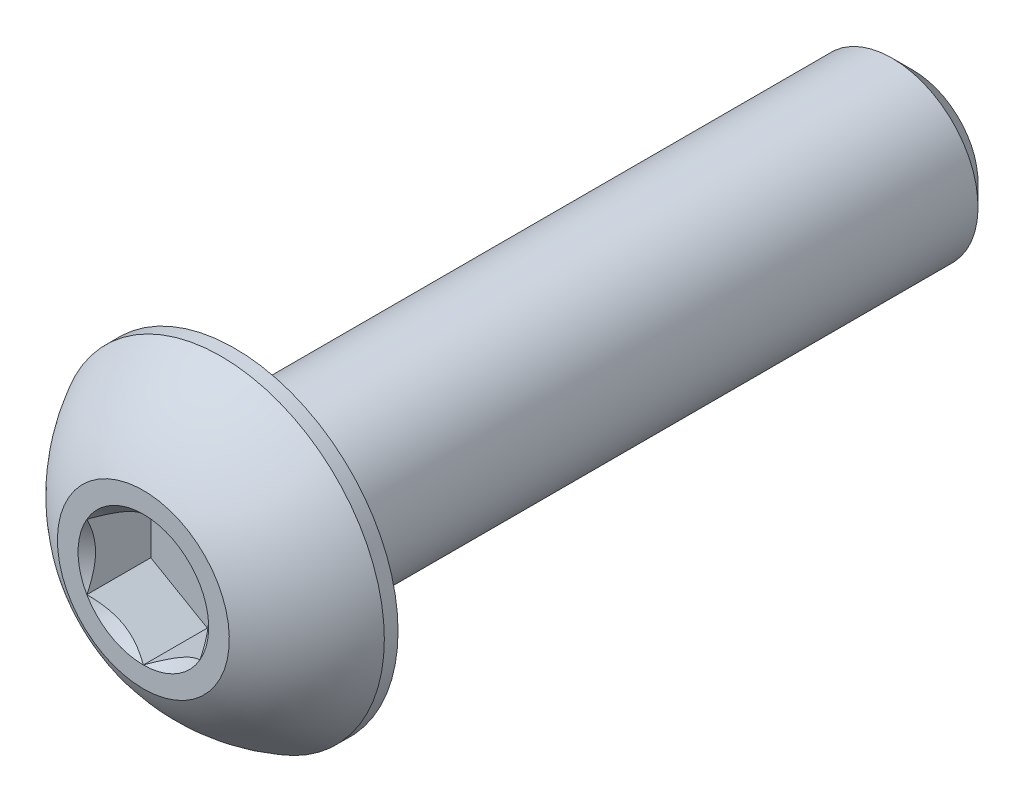
ISO-10303-21;
HEADER;
FILE_DESCRIPTION(('STEP AP214'),'2;1');
FILE_NAME('part.step','',(''),(''),'','','');
FILE_SCHEMA(('AUTOMOTIVE_DESIGN { 1 0 10303 214 1 1 1 1 }'));
ENDSEC;
DATA;
#1=APPLICATION_CONTEXT('core data for automotive mechanical design processes');
#2=APPLICATION_PROTOCOL_DEFINITION('international standard','automotive_design',2000,#1);
#3=PRODUCT_CONTEXT('',#1,'mechanical');
#4=PRODUCT('Part','Part','',(#3));
#5=PRODUCT_RELATED_PRODUCT_CATEGORY('part','',(#4));
#6=PRODUCT_DEFINITION_FORMATION('','',#4);
#7=PRODUCT_DEFINITION_CONTEXT('part definition',#1,'design');
#8=PRODUCT_DEFINITION('design','',#6,#7);
#9=PRODUCT_DEFINITION_SHAPE('','',#8);
#10=(LENGTH_UNIT() NAMED_UNIT(*) SI_UNIT(.MILLI.,.METRE.));
#11=(NAMED_UNIT(*) PLANE_ANGLE_UNIT() SI_UNIT($,.RADIAN.));
#12=(NAMED_UNIT(*) SI_UNIT($,.STERADIAN.) SOLID_ANGLE_UNIT());
#13=UNCERTAINTY_MEASURE_WITH_UNIT(LENGTH_MEASURE(1.E-05),#10,'distance_accuracy_value','');
#14=(GEOMETRIC_REPRESENTATION_CONTEXT(3) GLOBAL_UNCERTAINTY_ASSIGNED_CONTEXT((#13)) GLOBAL_UNIT_ASSIGNED_CONTEXT((#10,
#11,#12)) REPRESENTATION_CONTEXT('',''));
#15=CARTESIAN_POINT('',(0.,0.,0.));
#16=DIRECTION('',(0.,0.,1.));
#17=DIRECTION('',(1.,0.,0.));
#18=AXIS2_PLACEMENT_3D('',#15,#16,#17);
#19=CARTESIAN_POINT('',(0.,-2.41300000000001,-21.6154));
#20=DIRECTION('',(0.,0.,-1.));
#21=DIRECTION('',(0.,1.,0.));
#22=AXIS2_PLACEMENT_3D('',#19,#20,#21);
#23=PLANE('',#22);
#24=CARTESIAN_POINT('',(0.,0.,-21.6154));
#25=DIRECTION('',(0.,0.,-1.));
#26=DIRECTION('',(0.,1.,0.));
#27=AXIS2_PLACEMENT_3D('',#24,#25,#26);
#28=CIRCLE('',#27,1.81768750000001);
#29=CARTESIAN_POINT('',(0.,1.81768750000001,-21.6154));
#30=VERTEX_POINT('',#29);
#31=EDGE_CURVE('E45',#30,#30,#28,.T.);
#32=ORIENTED_EDGE('',*,*,#31,.T.);
#33=EDGE_LOOP('',(#32));
#34=FACE_BOUND('',#33,.T.);
#35=ADVANCED_FACE('F37',(#34),#23,.T.);
#36=CARTESIAN_POINT('',(0.,0.,-21.6154));
#37=DIRECTION('',(0.,0.,-1.));
#38=DIRECTION('',(0.,1.,0.));
#39=AXIS2_PLACEMENT_3D('',#36,#37,#38);
#40=CYLINDRICAL_SURFACE('',#39,2.413);
#41=CARTESIAN_POINT('',(0.,0.,-21.0200875));
#42=DIRECTION('',(0.,0.,-1.));
#43=DIRECTION('',(0.,1.,0.));
#44=AXIS2_PLACEMENT_3D('',#41,#42,#43);
#45=CIRCLE('',#44,2.413);
#46=CARTESIAN_POINT('',(0.,2.413,-21.0200875));
#47=VERTEX_POINT('',#46);
#48=EDGE_CURVE('E11',#47,#47,#45,.F.);
#49=ORIENTED_EDGE('',*,*,#48,.T.);
#50=EDGE_LOOP('',(#49));
#51=FACE_BOUND('',#50,.T.);
#52=CARTESIAN_POINT('',(0.,0.,-2.5654));
#53=DIRECTION('',(0.,0.,1.));
#54=DIRECTION('',(1.,0.,0.));
#55=AXIS2_PLACEMENT_3D('',#52,#53,#54);
#56=CIRCLE('',#55,2.413);
#57=CARTESIAN_POINT('',(2.413,0.,-2.5654));
#58=VERTEX_POINT('',#57);
#59=EDGE_CURVE('E171',#58,#58,#56,.F.);
#60=ORIENTED_EDGE('',*,*,#59,.T.);
#61=EDGE_LOOP('',(#60));
#62=FACE_BOUND('',#61,.T.);
#63=ADVANCED_FACE('F179',(#51,#62),#40,.T.);
#64=CARTESIAN_POINT('',(0.,0.,-21.6154));
#65=DIRECTION('',(0.,0.,1.));
#66=DIRECTION('',(0.,-1.,0.));
#67=AXIS2_PLACEMENT_3D('',#64,#65,#66);
#68=CONICAL_SURFACE('',#67,1.81768750000001,0.785398163397445);
#69=ORIENTED_EDGE('',*,*,#48,.F.);
#70=EDGE_LOOP('',(#69));
#71=FACE_BOUND('',#70,.T.);
#72=ORIENTED_EDGE('',*,*,#31,.F.);
#73=EDGE_LOOP('',(#72));
#74=FACE_BOUND('',#73,.T.);
#75=ADVANCED_FACE('F39',(#71,#74),#68,.T.);
#76=CARTESIAN_POINT('',(0.,0.,-4.5748806144438));
#77=DIRECTION('',(0.,0.,1.));
#78=DIRECTION('',(0.,-1.,0.));
#79=AXIS2_PLACEMENT_3D('',#76,#77,#78);
#80=SPHERICAL_SURFACE('',#79,5.17224338526463);
#81=CARTESIAN_POINT('',(0.,0.,0.));
#82=DIRECTION('',(0.,0.,1.));
#83=DIRECTION('',(1.,0.,0.));
#84=AXIS2_PLACEMENT_3D('',#81,#82,#83);
#85=CIRCLE('',#84,2.413);
#86=CARTESIAN_POINT('',(0.,-2.413,0.));
#87=VERTEX_POINT('',#86);
#88=EDGE_CURVE('E168',#87,#87,#85,.T.);
#89=CARTESIAN_POINT('',(0.,0.,-2.18059));
#90=DIRECTION('',(0.,0.,1.));
#91=DIRECTION('',(1.,0.,0.));
#92=AXIS2_PLACEMENT_3D('',#89,#90,#91);
#93=CIRCLE('',#92,4.5847);
#94=CARTESIAN_POINT('',(0.,-4.5847,-2.18059));
#95=VERTEX_POINT('',#94);
#96=EDGE_CURVE('E162',#95,#95,#93,.T.);
#97=CARTESIAN_POINT('',(0.,-2.413,0.));
#98=CARTESIAN_POINT('',(0.,-2.44179113663083,-0.0151857097788009));
#99=CARTESIAN_POINT('',(0.,-2.47043888331474,-0.0306432741933343));
#100=CARTESIAN_POINT('',(0.,-2.5274374690351,-0.0620964513369402));
#101=CARTESIAN_POINT('',(0.,-2.55578830807155,-0.0780920640660127));
#102=CARTESIAN_POINT('',(0.,-2.61218295074331,-0.110615676881771));
#103=CARTESIAN_POINT('',(0.,-2.64022675437863,-0.127143676968457));
#104=CARTESIAN_POINT('',(0.,-2.69599733629138,-0.160726162390165));
#105=CARTESIAN_POINT('',(0.,-2.72372411456882,-0.177780647725188));
#106=CARTESIAN_POINT('',(0.,-2.77885076121154,-0.21241002764294));
#107=CARTESIAN_POINT('',(0.,-2.80625062957682,-0.229984922225668));
#108=CARTESIAN_POINT('',(0.,-2.86071369040082,-0.265648855453746));
#109=CARTESIAN_POINT('',(0.,-2.88777688285954,-0.283737894099096));
#110=CARTESIAN_POINT('',(0.,-2.94155694533546,-0.320423667994127));
#111=CARTESIAN_POINT('',(0.,-2.96827381535265,-0.339020403243808));
#112=CARTESIAN_POINT('',(0.,-3.02135171000009,-0.37671494166065));
#113=CARTESIAN_POINT('',(0.,-3.04771273463033,-0.39581274482781));
#114=CARTESIAN_POINT('',(0.,-3.10006954235699,-0.434502611862808));
#115=CARTESIAN_POINT('',(0.,-3.12606532545341,-0.454094675730644));
#116=CARTESIAN_POINT('',(0.,-3.17768238416296,-0.493766080756604));
#117=CARTESIAN_POINT('',(0.,-3.20330365977609,-0.513845421914727));
#118=CARTESIAN_POINT('',(0.,-3.25416257105645,-0.554484224430573));
#119=CARTESIAN_POINT('',(0.,-3.27940020672367,-0.575043685788297));
#120=CARTESIAN_POINT('',(0.,-3.32948284239517,-0.616635400476975));
#121=CARTESIAN_POINT('',(0.,-3.35432784239946,-0.63766765380793));
#122=CARTESIAN_POINT('',(0.,-3.40361635097913,-0.680197455694829));
#123=CARTESIAN_POINT('',(0.,-3.42805985955453,-0.701695004250773));
#124=CARTESIAN_POINT('',(0.,-3.47653667261836,-0.745147733989217));
#125=CARTESIAN_POINT('',(0.,-3.5005699771068,-0.767102915171716));
#126=CARTESIAN_POINT('',(0.,-3.54821781555203,-0.81146308444603));
#127=CARTESIAN_POINT('',(0.,-3.57183234950881,-0.833868072537843));
#128=CARTESIAN_POINT('',(0.,-3.61863422971284,-0.879119869584105));
#129=CARTESIAN_POINT('',(0.,-3.64182157596008,-0.901966678538555));
#130=CARTESIAN_POINT('',(0.,-3.68776081583415,-0.948093973780533));
#131=CARTESIAN_POINT('',(0.,-3.71051270946098,-0.971374460068061));
#132=CARTESIAN_POINT('',(0.,-3.75557293439636,-1.01836081186645));
#133=CARTESIAN_POINT('',(0.,-3.7778812657049,-1.0420666773773));
#134=CARTESIAN_POINT('',(0.,-3.82204641440941,-1.08989533789018));
#135=CARTESIAN_POINT('',(0.,-3.84390323180538,-1.11401813289221));
#136=CARTESIAN_POINT('',(0.,-3.88715756202836,-1.16267205404467));
#137=CARTESIAN_POINT('',(0.,-3.90855507485536,-1.18720318019511));
#138=CARTESIAN_POINT('',(0.,-3.95088316899876,-1.23666501975588));
#139=CARTESIAN_POINT('',(0.,-3.97181375031515,-1.26159573316622));
#140=CARTESIAN_POINT('',(0.,-4.01320052092912,-1.31184786092909));
#141=CARTESIAN_POINT('',(0.,-4.03365671022669,-1.33716927528163));
#142=CARTESIAN_POINT('',(0.,-4.07408740538699,-1.38819377934977));
#143=CARTESIAN_POINT('',(0.,-4.09406191124973,-1.41389686906536));
#144=CARTESIAN_POINT('',(0.,-4.13352211981722,-1.46567556223513));
#145=CARTESIAN_POINT('',(0.,-4.15300782252198,-1.4917511656893));
#146=CARTESIAN_POINT('',(0.,-4.19148347927457,-1.54426559193551));
#147=CARTESIAN_POINT('',(0.,-4.2104734333224,-1.57070441472756));
#148=CARTESIAN_POINT('',(0.,-4.24795082398615,-1.6239358557723));
#149=CARTESIAN_POINT('',(0.,-4.26643826060207,-1.65072847402499));
#150=CARTESIAN_POINT('',(0.,-4.3029040266735,-1.70465795604563));
#151=CARTESIAN_POINT('',(0.,-4.32088235612901,-1.73179481981358));
#152=CARTESIAN_POINT('',(0.,-4.35632349988304,-1.78640312007115));
#153=CARTESIAN_POINT('',(0.,-4.37378631418156,-1.81387455656079));
#154=CARTESIAN_POINT('',(0.,-4.40819020238474,-1.86914221075438));
#155=CARTESIAN_POINT('',(0.,-4.42513127628939,-1.89693842845834));
#156=CARTESIAN_POINT('',(0.,-4.45848564813517,-1.95284573578717));
#157=CARTESIAN_POINT('',(0.,-4.4748989460763,-1.98095682541204));
#158=CARTESIAN_POINT('',(0.,-4.50719190474587,-2.03748386259807));
#159=CARTESIAN_POINT('',(0.,-4.5230715654743,-2.06589981015923));
#160=CARTESIAN_POINT('',(0.,-4.55429163018258,-2.12302641242262));
#161=CARTESIAN_POINT('',(0.,-4.56963203416241,-2.15173706712485));
#162=CARTESIAN_POINT('',(0.,-4.5847,-2.18059));
#163=B_SPLINE_CURVE_WITH_KNOTS('',3,(#97,#98,#99,#100,#101,#102,#103,#104,#105,#106,#107,#108,
#109,#110,#111,#112,#113,#114,#115,#116,#117,#118,#119,#120,#121,#122,#123,#124,#125,#126,#127,
#128,#129,#130,#131,#132,#133,#134,#135,#136,#137,#138,#139,#140,#141,#142,#143,#144,#145,#146,
#147,#148,#149,#150,#151,#152,#153,#154,#155,#156,#157,#158,#159,#160,#161,#162),.UNSPECIFIED.,
.F.,.F.,(4,2,2,2,2,2,2,2,2,2,2,2,2,2,2,2,2,2,2,2,2,2,2,2,2,2,2,2,2,2,2,2,4),(0.,
0.0976500604051489,0.195300120810298,0.292950181215447,0.390600241620598,0.488250302025747,
0.585900362430896,0.683550422836046,0.781200483241194,0.878850543646344,0.976500604051493,
1.07415066445664,1.17180072486179,1.26945078526694,1.36710084567209,1.46475090607724,
1.56240096648239,1.66005102688754,1.75770108729269,1.85535114769784,1.95300120810299,
2.05065126850814,2.14830132891329,2.24595138931843,2.34360144972358,2.44125151012873,
2.53890157053388,2.63655163093903,2.73420169134418,2.83185175174933,2.92950181215448,
3.02715187255963,3.12480193296478),.UNSPECIFIED.);
#164=EDGE_CURVE('BSEAM178',#87,#95,#163,.T.);
#165=ORIENTED_EDGE('',*,*,#88,.F.);
#166=ORIENTED_EDGE('',*,*,#96,.T.);
#167=ORIENTED_EDGE('',*,*,#164,.T.);
#168=ORIENTED_EDGE('',*,*,#164,.F.);
#169=EDGE_LOOP('',(#165,#167,#166,#168));
#170=FACE_BOUND('',#169,.T.);
#171=ADVANCED_FACE('F178',(#170),#80,.T.);
#172=CARTESIAN_POINT('',(0.,-2.413,0.));
#173=DIRECTION('',(0.,0.,-1.));
#174=DIRECTION('',(-1.,0.,0.));
#175=AXIS2_PLACEMENT_3D('',#172,#173,#174);
#176=PLANE('',#175);
#177=CARTESIAN_POINT('',(0.,0.,0.));
#178=DIRECTION('',(0.,0.,1.));
#179=DIRECTION('',(1.,0.,0.));
#180=AXIS2_PLACEMENT_3D('',#177,#178,#179);
#181=CIRCLE('',#180,1.83308710467706);
#182=CARTESIAN_POINT('',(-1.5875,0.91654355233853,0.));
#183=VERTEX_POINT('',#182);
#184=CARTESIAN_POINT('',(-1.5875,-0.916543552338531,0.));
#185=VERTEX_POINT('',#184);
#186=EDGE_CURVE('E58',#183,#185,#181,.T.);
#187=ORIENTED_EDGE('',*,*,#186,.F.);
#188=CARTESIAN_POINT('',(0.,1.83308710467706,0.));
#189=VERTEX_POINT('',#188);
#190=EDGE_CURVE('E132',#189,#183,#181,.T.);
#191=ORIENTED_EDGE('',*,*,#190,.F.);
#192=CARTESIAN_POINT('',(1.5875,0.916543552338531,0.));
#193=VERTEX_POINT('',#192);
#194=EDGE_CURVE('E109',#193,#189,#181,.T.);
#195=ORIENTED_EDGE('',*,*,#194,.F.);
#196=CARTESIAN_POINT('',(1.5875,-0.916543552338531,0.));
#197=VERTEX_POINT('',#196);
#198=EDGE_CURVE('E98',#197,#193,#181,.T.);
#199=ORIENTED_EDGE('',*,*,#198,.F.);
#200=CARTESIAN_POINT('',(0.,-1.83308710467706,0.));
#201=VERTEX_POINT('',#200);
#202=EDGE_CURVE('E90',#201,#197,#181,.T.);
#203=ORIENTED_EDGE('',*,*,#202,.F.);
#204=EDGE_CURVE('E51',#185,#201,#181,.T.);
#205=ORIENTED_EDGE('',*,*,#204,.F.);
#206=EDGE_LOOP('',(#187,#191,#195,#199,#203,#205));
#207=FACE_BOUND('',#206,.T.);
#208=ORIENTED_EDGE('',*,*,#88,.T.);
#209=EDGE_LOOP('',(#208));
#210=FACE_BOUND('',#209,.T.);
#211=ADVANCED_FACE('F129',(#207,#210),#176,.F.);
#212=CARTESIAN_POINT('',(0.,-4.5847,-2.5654));
#213=DIRECTION('',(0.,0.,1.));
#214=DIRECTION('',(1.,0.,0.));
#215=AXIS2_PLACEMENT_3D('',#212,#213,#214);
#216=PLANE('',#215);
#217=ORIENTED_EDGE('',*,*,#59,.F.);
#218=EDGE_LOOP('',(#217));
#219=FACE_BOUND('',#218,.T.);
#220=CARTESIAN_POINT('',(0.,0.,-2.5654));
#221=DIRECTION('',(0.,0.,1.));
#222=DIRECTION('',(1.,0.,0.));
#223=AXIS2_PLACEMENT_3D('',#220,#221,#222);
#224=CIRCLE('',#223,4.5847);
#225=CARTESIAN_POINT('',(4.5847,0.,-2.5654));
#226=VERTEX_POINT('',#225);
#227=EDGE_CURVE('E165',#226,#226,#224,.T.);
#228=ORIENTED_EDGE('',*,*,#227,.F.);
#229=EDGE_LOOP('',(#228));
#230=FACE_BOUND('',#229,.T.);
#231=ADVANCED_FACE('F196',(#219,#230),#216,.F.);
#232=CARTESIAN_POINT('',(0.,0.,0.));
#233=DIRECTION('',(0.,0.,1.));
#234=DIRECTION('',(1.,0.,0.));
#235=AXIS2_PLACEMENT_3D('',#232,#233,#234);
#236=CYLINDRICAL_SURFACE('',#235,4.5847);
#237=ORIENTED_EDGE('',*,*,#96,.F.);
#238=EDGE_LOOP('',(#237));
#239=FACE_BOUND('',#238,.T.);
#240=ORIENTED_EDGE('',*,*,#227,.T.);
#241=EDGE_LOOP('',(#240));
#242=FACE_BOUND('',#241,.T.);
#243=ADVANCED_FACE('F199',(#239,#242),#236,.T.);
#244=CARTESIAN_POINT('',(0.,0.,0.));
#245=DIRECTION('',(0.,0.,1.));
#246=DIRECTION('',(1.,0.,0.));
#247=AXIS2_PLACEMENT_3D('',#244,#245,#246);
#248=CONICAL_SURFACE('',#247,1.83308710467706,0.78539816339745);
#249=ORIENTED_EDGE('',*,*,#198,.T.);
#250=CARTESIAN_POINT('',(1.5875,-1.83163614232865,0.590762562254565));
#251=CARTESIAN_POINT('',(1.5875,-1.78705354844902,0.55707785480324));
#252=CARTESIAN_POINT('',(1.5875,-1.74222294150555,0.523722329968627));
#253=CARTESIAN_POINT('',(1.5875,-1.65196486784504,0.457805675888285));
#254=CARTESIAN_POINT('',(1.5875,-1.60653725449665,0.425244747634468));
#255=CARTESIAN_POINT('',(1.5875,-1.46854281940082,0.328493449461236));
#256=CARTESIAN_POINT('',(1.5875,-1.37494211623386,0.265753264612858));
#257=CARTESIAN_POINT('',(1.5875,-1.17864136265695,0.142553151294645));
#258=CARTESIAN_POINT('',(1.5875,-1.07572731596385,0.0824303289226488));
#259=CARTESIAN_POINT('',(1.5875,-0.864754189558117,-0.0275706334490079));
#260=CARTESIAN_POINT('',(1.5875,-0.756714033301438,-0.0774833149376714));
#261=CARTESIAN_POINT('',(1.5875,-0.594580029688666,-0.138547963751185));
#262=CARTESIAN_POINT('',(1.5875,-0.542894373932897,-0.156067797502568));
#263=CARTESIAN_POINT('',(1.5875,-0.43827206291756,-0.186958420156953));
#264=CARTESIAN_POINT('',(1.5875,-0.3853353220534,-0.200328924255393));
#265=CARTESIAN_POINT('',(1.5875,-0.27941340073437,-0.222002681044568));
#266=CARTESIAN_POINT('',(1.5875,-0.226446313904206,-0.230392976800141));
#267=CARTESIAN_POINT('',(1.5875,-0.119941637592404,-0.241941911012322));
#268=CARTESIAN_POINT('',(1.5875,-0.0664041486263234,-0.245101456366562));
#269=CARTESIAN_POINT('',(1.5875,0.0387581192420279,-0.245952982965122));
#270=CARTESIAN_POINT('',(1.5875,0.090381381554216,-0.243840334608509));
#271=CARTESIAN_POINT('',(1.5875,0.19318730201683,-0.234695846678065));
#272=CARTESIAN_POINT('',(1.5875,0.244369916988517,-0.227663530460197));
#273=CARTESIAN_POINT('',(1.5875,0.346790527788956,-0.208944949355169));
#274=CARTESIAN_POINT('',(1.5875,0.398013804172139,-0.197179358640977));
#275=CARTESIAN_POINT('',(1.5875,0.499340680307276,-0.169620657149212));
#276=CARTESIAN_POINT('',(1.5875,0.549444372105894,-0.153827878801824));
#277=CARTESIAN_POINT('',(1.5875,0.707022639586407,-0.0982133790717417));
#278=CARTESIAN_POINT('',(1.5875,0.812258737570578,-0.0520647672653368));
#279=CARTESIAN_POINT('',(1.5875,1.01778869013701,0.0505458403808823));
#280=CARTESIAN_POINT('',(1.5875,1.11806310933257,0.107044855107553));
#281=CARTESIAN_POINT('',(1.5875,1.30970442577157,0.223612502972616));
#282=CARTESIAN_POINT('',(1.5875,1.40126637149297,0.283364441978613));
#283=CARTESIAN_POINT('',(1.5875,1.53616443073864,0.37573700869171));
#284=CARTESIAN_POINT('',(1.5875,1.58054835823549,0.406854014274728));
#285=CARTESIAN_POINT('',(1.5875,1.66870952512132,0.469911550181166));
#286=CARTESIAN_POINT('',(1.5875,1.71248692801697,0.501851851647461));
#287=CARTESIAN_POINT('',(1.5875,1.75601179240957,0.534133557847131));
#288=B_SPLINE_CURVE_WITH_KNOTS('',3,(#250,#251,#252,#253,#254,#255,#256,#257,#258,#259,#260,
#261,#262,#263,#264,#265,#266,#267,#268,#269,#270,#271,#272,#273,#274,#275,#276,#277,#278,#279,
#280,#281,#282,#283,#284,#285,#286,#287),.UNSPECIFIED.,.F.,.F.,(4,2,2,2,2,2,2,2,2,2,2,2,2,2,2,2,
2,2,4),(0.,0.167627505127548,0.33529698084648,0.673194674702938,1.0304700708717,
1.38651603079307,1.55010049300858,1.71369618096554,1.87434127467533,2.034958513124,
2.18971280484453,2.34448209207484,2.50196108385089,2.65942708049529,3.00314617711216,
3.34811949873714,3.6759579216973,3.83856722085481,4.00113179576279),.UNSPECIFIED.);
#289=EDGE_CURVE('E103',#197,#193,#288,.T.);
#290=ORIENTED_EDGE('',*,*,#289,.F.);
#291=EDGE_LOOP('',(#249,#290));
#292=FACE_BOUND('',#291,.T.);
#293=ADVANCED_FACE('F104',(#292),#248,.F.);
#294=ORIENTED_EDGE('',*,*,#194,.T.);
#295=CARTESIAN_POINT('',(1.5877,0.916428082284693,0.000115480963706964));
#296=CARTESIAN_POINT('',(1.53312479190086,0.947937093371809,-0.0313691916294028));
#297=CARTESIAN_POINT('',(1.47763696320971,0.979973006203395,-0.0610049539864698));
#298=CARTESIAN_POINT('',(1.36449087915364,1.04529792829092,-0.115267739979175));
#299=CARTESIAN_POINT('',(1.30682185887062,1.07859315267522,-0.139864564866823));
#300=CARTESIAN_POINT('',(1.1905349781269,1.14573141457583,-0.181999635727418));
#301=CARTESIAN_POINT('',(1.13194674474407,1.17955734689075,-0.199643807270178));
#302=CARTESIAN_POINT('',(1.01348022674557,1.24795402294714,-0.226828529915031));
#303=CARTESIAN_POINT('',(0.953605562983896,1.28252267618758,-0.236389379304923));
#304=CARTESIAN_POINT('',(0.850418771876558,1.34209759781022,-0.245015586895992));
#305=CARTESIAN_POINT('',(0.807240015952288,1.36702686416637,-0.246292807190424));
#306=CARTESIAN_POINT('',(0.720953038535399,1.41684467380557,-0.244142944185295));
#307=CARTESIAN_POINT('',(0.677844847078612,1.44173319974742,-0.240714211450657));
#308=CARTESIAN_POINT('',(0.592046335002031,1.49126899379091,-0.229349005566657));
#309=CARTESIAN_POINT('',(0.549356408925407,1.51591603410293,-0.221408628198358));
#310=CARTESIAN_POINT('',(0.464693063478359,1.56479643938728,-0.201451585548899));
#311=CARTESIAN_POINT('',(0.422719959755075,1.58902962212064,-0.189433170791309));
#312=CARTESIAN_POINT('',(0.315211458113566,1.65109968448354,-0.153753102752754));
#313=CARTESIAN_POINT('',(0.2503427717089,1.68855163804125,-0.127401427696863));
#314=CARTESIAN_POINT('',(0.154961599380924,1.74361998356043,-0.082916463148298));
#315=CARTESIAN_POINT('',(0.123530699536157,1.76176662204668,-0.0672871421988686));
#316=CARTESIAN_POINT('',(0.0612469855696368,1.79772614107138,-0.0346015121388987));
#317=CARTESIAN_POINT('',(0.0303939039605763,1.8155391760437,-0.0175458843430302));
#318=CARTESIAN_POINT('',(-0.000200000000000412,1.8332025747309,0.000115480963706783));
#319=B_SPLINE_CURVE_WITH_KNOTS('',3,(#295,#296,#297,#298,#299,#300,#301,#302,#303,#304,#305,
#306,#307,#308,#309,#310,#311,#312,#313,#314,#315,#316,#317,#318),.UNSPECIFIED.,.F.,.F.,(4,2,2,
2,2,2,2,2,2,2,2,4),(0.,0.211482650810816,0.424197870807275,0.633533884524815,0.842342653263348,
0.99175555372714,1.14122083674204,1.29081565918877,1.44047473906437,1.6781878086972,
1.79671410024894,1.91518409436631),.UNSPECIFIED.);
#320=EDGE_CURVE('E108',#193,#189,#319,.T.);
#321=ORIENTED_EDGE('',*,*,#320,.F.);
#322=EDGE_LOOP('',(#294,#321));
#323=FACE_BOUND('',#322,.T.);
#324=ADVANCED_FACE('F290',(#323),#248,.F.);
#325=ORIENTED_EDGE('',*,*,#190,.T.);
#326=CARTESIAN_POINT('',(0.000199999999999602,1.8332025747309,0.000115480963706835));
#327=CARTESIAN_POINT('',(-0.0543752080991368,1.80169356364378,-0.031369191629403));
#328=CARTESIAN_POINT('',(-0.10986303679029,1.7696576508122,-0.06100495398647));
#329=CARTESIAN_POINT('',(-0.223009120846359,1.70433272872467,-0.115267739979175));
#330=CARTESIAN_POINT('',(-0.280678141129381,1.67103750434037,-0.139864564866824));
#331=CARTESIAN_POINT('',(-0.396965021873103,1.60389924243976,-0.181999635727418));
#332=CARTESIAN_POINT('',(-0.455553255255931,1.57007331012484,-0.199643807270178));
#333=CARTESIAN_POINT('',(-0.574019773254431,1.50167663406845,-0.226828529915031));
#334=CARTESIAN_POINT('',(-0.633894437016105,1.46710798082801,-0.236389379304923));
#335=CARTESIAN_POINT('',(-0.737081228123443,1.40753305920537,-0.245015586895992));
#336=CARTESIAN_POINT('',(-0.780259984047713,1.38260379284922,-0.246292807190424));
#337=CARTESIAN_POINT('',(-0.866546961464602,1.33278598321002,-0.244142944185295));
#338=CARTESIAN_POINT('',(-0.909655152921388,1.30789745726817,-0.240714211450657));
#339=CARTESIAN_POINT('',(-0.99545366499797,1.25836166322468,-0.229349005566657));
#340=CARTESIAN_POINT('',(-1.03814359107459,1.23371462291266,-0.221408628198358));
#341=CARTESIAN_POINT('',(-1.12280693652164,1.18483421762831,-0.201451585548899));
#342=CARTESIAN_POINT('',(-1.16478004024493,1.16060103489495,-0.189433170791309));
#343=CARTESIAN_POINT('',(-1.27228854188643,1.09853097253205,-0.153753102752754));
#344=CARTESIAN_POINT('',(-1.3371572282911,1.06107901897434,-0.127401427696863));
#345=CARTESIAN_POINT('',(-1.43253840061908,1.00601067345516,-0.082916463148298));
#346=CARTESIAN_POINT('',(-1.46396930046384,0.987864034968913,-0.0672871421988685));
#347=CARTESIAN_POINT('',(-1.52625301443036,0.951904515944214,-0.0346015121388985));
#348=CARTESIAN_POINT('',(-1.55710609603942,0.934091480971893,-0.0175458843430301));
#349=CARTESIAN_POINT('',(-1.5877,0.916428082284692,0.000115480963706555));
#350=B_SPLINE_CURVE_WITH_KNOTS('',3,(#326,#327,#328,#329,#330,#331,#332,#333,#334,#335,#336,
#337,#338,#339,#340,#341,#342,#343,#344,#345,#346,#347,#348,#349),.UNSPECIFIED.,.F.,.F.,(4,2,2,
2,2,2,2,2,2,2,2,4),(0.,0.211482650810816,0.424197870807276,0.633533884524816,0.842342653263348,
0.991755553727141,1.14122083674205,1.29081565918877,1.44047473906438,1.6781878086972,
1.79671410024894,1.91518409436631),.UNSPECIFIED.);
#351=EDGE_CURVE('E139',#189,#183,#350,.T.);
#352=ORIENTED_EDGE('',*,*,#351,.F.);
#353=EDGE_LOOP('',(#325,#352));
#354=FACE_BOUND('',#353,.T.);
#355=ADVANCED_FACE('F137',(#354),#248,.F.);
#356=ORIENTED_EDGE('',*,*,#186,.T.);
#357=CARTESIAN_POINT('',(-1.5875,-1.83163614232865,0.590762562254564));
#358=CARTESIAN_POINT('',(-1.5875,-1.78705354844902,0.557077854803239));
#359=CARTESIAN_POINT('',(-1.5875,-1.74222294150555,0.523722329968626));
#360=CARTESIAN_POINT('',(-1.5875,-1.65196486784504,0.457805675888285));
#361=CARTESIAN_POINT('',(-1.5875,-1.60653725449665,0.425244747634468));
#362=CARTESIAN_POINT('',(-1.5875,-1.46854281940082,0.328493449461235));
#363=CARTESIAN_POINT('',(-1.5875,-1.37494211623386,0.265753264612857));
#364=CARTESIAN_POINT('',(-1.5875,-1.17864136265695,0.142553151294644));
#365=CARTESIAN_POINT('',(-1.5875,-1.07572731596385,0.0824303289226486));
#366=CARTESIAN_POINT('',(-1.5875,-0.864754189558117,-0.0275706334490081));
#367=CARTESIAN_POINT('',(-1.5875,-0.756714033301438,-0.0774833149376718));
#368=CARTESIAN_POINT('',(-1.5875,-0.594580029688666,-0.138547963751185));
#369=CARTESIAN_POINT('',(-1.5875,-0.542894373932898,-0.156067797502568));
#370=CARTESIAN_POINT('',(-1.5875,-0.438272062917561,-0.186958420156953));
#371=CARTESIAN_POINT('',(-1.5875,-0.385335322053401,-0.200328924255393));
#372=CARTESIAN_POINT('',(-1.5875,-0.27941340073437,-0.222002681044568));
#373=CARTESIAN_POINT('',(-1.5875,-0.226446313904207,-0.230392976800141));
#374=CARTESIAN_POINT('',(-1.5875,-0.119941637592405,-0.241941911012322));
#375=CARTESIAN_POINT('',(-1.5875,-0.0664041486263238,-0.245101456366562));
#376=CARTESIAN_POINT('',(-1.5875,0.0387581192420274,-0.245952982965122));
#377=CARTESIAN_POINT('',(-1.5875,0.0903813815542156,-0.243840334608509));
#378=CARTESIAN_POINT('',(-1.5875,0.193187302016829,-0.234695846678065));
#379=CARTESIAN_POINT('',(-1.5875,0.244369916988516,-0.227663530460197));
#380=CARTESIAN_POINT('',(-1.5875,0.346790527788956,-0.208944949355169));
#381=CARTESIAN_POINT('',(-1.5875,0.398013804172139,-0.197179358640977));
#382=CARTESIAN_POINT('',(-1.5875,0.499340680307276,-0.169620657149213));
#383=CARTESIAN_POINT('',(-1.5875,0.549444372105893,-0.153827878801824));
#384=CARTESIAN_POINT('',(-1.5875,0.707022639586407,-0.0982133790717423));
#385=CARTESIAN_POINT('',(-1.5875,0.812258737570577,-0.0520647672653372));
#386=CARTESIAN_POINT('',(-1.5875,1.01778869013701,0.050545840380882));
#387=CARTESIAN_POINT('',(-1.5875,1.11806310933256,0.107044855107552));
#388=CARTESIAN_POINT('',(-1.5875,1.30970442577157,0.223612502972616));
#389=CARTESIAN_POINT('',(-1.5875,1.40126637149297,0.283364441978612));
#390=CARTESIAN_POINT('',(-1.5875,1.53616443073864,0.375737008691709));
#391=CARTESIAN_POINT('',(-1.5875,1.58054835823549,0.406854014274727));
#392=CARTESIAN_POINT('',(-1.5875,1.66870952512132,0.469911550181165));
#393=CARTESIAN_POINT('',(-1.5875,1.71248692801697,0.50185185164746));
#394=CARTESIAN_POINT('',(-1.5875,1.75601179240957,0.53413355784713));
#395=B_SPLINE_CURVE_WITH_KNOTS('',3,(#357,#358,#359,#360,#361,#362,#363,#364,#365,#366,#367,
#368,#369,#370,#371,#372,#373,#374,#375,#376,#377,#378,#379,#380,#381,#382,#383,#384,#385,#386,
#387,#388,#389,#390,#391,#392,#393,#394),.UNSPECIFIED.,.F.,.F.,(4,2,2,2,2,2,2,2,2,2,2,2,2,2,2,2,
2,2,4),(0.,0.167627505127548,0.335296980846479,0.673194674702938,1.0304700708717,
1.38651603079307,1.55010049300858,1.71369618096554,1.87434127467533,2.034958513124,
2.18971280484453,2.34448209207484,2.50196108385089,2.65942708049529,3.00314617711216,
3.34811949873714,3.67595792169729,3.83856722085481,4.00113179576279),.UNSPECIFIED.);
#396=EDGE_CURVE('E143',#183,#185,#395,.F.);
#397=ORIENTED_EDGE('',*,*,#396,.F.);
#398=EDGE_LOOP('',(#356,#397));
#399=FACE_BOUND('',#398,.T.);
#400=ADVANCED_FACE('F284',(#399),#248,.F.);
#401=ORIENTED_EDGE('',*,*,#204,.T.);
#402=CARTESIAN_POINT('',(-1.5877,-0.916428082284693,0.000115480963706531));
#403=CARTESIAN_POINT('',(-1.53312479190086,-0.947937093371809,-0.0313691916294031));
#404=CARTESIAN_POINT('',(-1.47763696320971,-0.979973006203394,-0.06100495398647));
#405=CARTESIAN_POINT('',(-1.36449087915364,-1.04529792829092,-0.115267739979175));
#406=CARTESIAN_POINT('',(-1.30682185887062,-1.07859315267522,-0.139864564866824));
#407=CARTESIAN_POINT('',(-1.1905349781269,-1.14573141457583,-0.181999635727418));
#408=CARTESIAN_POINT('',(-1.13194674474407,-1.17955734689075,-0.199643807270178));
#409=CARTESIAN_POINT('',(-1.01348022674557,-1.24795402294714,-0.226828529915031));
#410=CARTESIAN_POINT('',(-0.953605562983895,-1.28252267618758,-0.236389379304923));
#411=CARTESIAN_POINT('',(-0.850418771876558,-1.34209759781022,-0.245015586895992));
#412=CARTESIAN_POINT('',(-0.807240015952288,-1.36702686416637,-0.246292807190424));
#413=CARTESIAN_POINT('',(-0.720953038535399,-1.41684467380557,-0.244142944185295));
#414=CARTESIAN_POINT('',(-0.677844847078612,-1.44173319974742,-0.240714211450657));
#415=CARTESIAN_POINT('',(-0.592046335002031,-1.49126899379091,-0.229349005566657));
#416=CARTESIAN_POINT('',(-0.549356408925407,-1.51591603410293,-0.221408628198358));
#417=CARTESIAN_POINT('',(-0.464693063478359,-1.56479643938728,-0.201451585548899));
#418=CARTESIAN_POINT('',(-0.422719959755075,-1.58902962212064,-0.189433170791309));
#419=CARTESIAN_POINT('',(-0.315211458113566,-1.65109968448354,-0.153753102752754));
#420=CARTESIAN_POINT('',(-0.2503427717089,-1.68855163804125,-0.127401427696864));
#421=CARTESIAN_POINT('',(-0.154961599380924,-1.74361998356043,-0.082916463148298));
#422=CARTESIAN_POINT('',(-0.123530699536156,-1.76176662204668,-0.0672871421988684));
#423=CARTESIAN_POINT('',(-0.0612469855696366,-1.79772614107138,-0.0346015121388983));
#424=CARTESIAN_POINT('',(-0.030393903960576,-1.8155391760437,-0.0175458843430298));
#425=CARTESIAN_POINT('',(0.000200000000000753,-1.8332025747309,0.000115480963706965));
#426=B_SPLINE_CURVE_WITH_KNOTS('',3,(#402,#403,#404,#405,#406,#407,#408,#409,#410,#411,#412,
#413,#414,#415,#416,#417,#418,#419,#420,#421,#422,#423,#424,#425),.UNSPECIFIED.,.F.,.F.,(4,2,2,
2,2,2,2,2,2,2,2,4),(0.,0.211482650810816,0.424197870807275,0.633533884524815,0.842342653263347,
0.99175555372714,1.14122083674204,1.29081565918877,1.44047473906437,1.6781878086972,
1.79671410024894,1.91518409436631),.UNSPECIFIED.);
#427=EDGE_CURVE('E119',#185,#201,#426,.T.);
#428=ORIENTED_EDGE('',*,*,#427,.F.);
#429=EDGE_LOOP('',(#401,#428));
#430=FACE_BOUND('',#429,.T.);
#431=ADVANCED_FACE('F228',(#430),#248,.F.);
#432=ORIENTED_EDGE('',*,*,#202,.T.);
#433=CARTESIAN_POINT('',(-0.000199999999999123,-1.8332025747309,0.000115480963707269));
#434=CARTESIAN_POINT('',(0.0543752080991372,-1.80169356364378,-0.0313691916294027));
#435=CARTESIAN_POINT('',(0.109863036790291,-1.7696576508122,-0.0610049539864697));
#436=CARTESIAN_POINT('',(0.22300912084636,-1.70433272872467,-0.115267739979174));
#437=CARTESIAN_POINT('',(0.280678141129382,-1.67103750434037,-0.139864564866823));
#438=CARTESIAN_POINT('',(0.396965021873104,-1.60389924243976,-0.181999635727418));
#439=CARTESIAN_POINT('',(0.455553255255932,-1.57007331012484,-0.199643807270178));
#440=CARTESIAN_POINT('',(0.574019773254432,-1.50167663406845,-0.226828529915031));
#441=CARTESIAN_POINT('',(0.633894437016106,-1.46710798082801,-0.236389379304922));
#442=CARTESIAN_POINT('',(0.737081228123443,-1.40753305920537,-0.245015586895992));
#443=CARTESIAN_POINT('',(0.780259984047713,-1.38260379284922,-0.246292807190423));
#444=CARTESIAN_POINT('',(0.866546961464602,-1.33278598321002,-0.244142944185295));
#445=CARTESIAN_POINT('',(0.909655152921389,-1.30789745726817,-0.240714211450656));
#446=CARTESIAN_POINT('',(0.99545366499797,-1.25836166322468,-0.229349005566656));
#447=CARTESIAN_POINT('',(1.03814359107459,-1.23371462291266,-0.221408628198358));
#448=CARTESIAN_POINT('',(1.12280693652164,-1.18483421762831,-0.201451585548898));
#449=CARTESIAN_POINT('',(1.16478004024493,-1.16060103489495,-0.189433170791309));
#450=CARTESIAN_POINT('',(1.27228854188643,-1.09853097253205,-0.153753102752754));
#451=CARTESIAN_POINT('',(1.3371572282911,-1.06107901897434,-0.127401427696863));
#452=CARTESIAN_POINT('',(1.43253840061908,-1.00601067345516,-0.0829164631482976));
#453=CARTESIAN_POINT('',(1.46396930046384,-0.987864034968914,-0.0672871421988682));
#454=CARTESIAN_POINT('',(1.52625301443036,-0.951904515944214,-0.0346015121388983));
#455=CARTESIAN_POINT('',(1.55710609603942,-0.934091480971893,-0.0175458843430299));
#456=CARTESIAN_POINT('',(1.5877,-0.916428082284693,0.000115480963706771));
#457=B_SPLINE_CURVE_WITH_KNOTS('',3,(#433,#434,#435,#436,#437,#438,#439,#440,#441,#442,#443,
#444,#445,#446,#447,#448,#449,#450,#451,#452,#453,#454,#455,#456),.UNSPECIFIED.,.F.,.F.,(4,2,2,
2,2,2,2,2,2,2,2,4),(0.,0.211482650810816,0.424197870807276,0.633533884524815,0.842342653263348,
0.991755553727141,1.14122083674205,1.29081565918877,1.44047473906438,1.6781878086972,
1.79671410024894,1.91518409436631),.UNSPECIFIED.);
#458=EDGE_CURVE('E94',#201,#197,#457,.T.);
#459=ORIENTED_EDGE('',*,*,#458,.F.);
#460=EDGE_LOOP('',(#432,#459));
#461=FACE_BOUND('',#460,.T.);
#462=ADVANCED_FACE('F92',(#461),#248,.F.);
#463=CARTESIAN_POINT('',(1.5875,-0.916543552338531,-1.79578));
#464=DIRECTION('',(0.,0.,1.));
#465=DIRECTION('',(1.,0.,0.));
#466=AXIS2_PLACEMENT_3D('',#463,#464,#465);
#467=PLANE('',#466);
#468=DIRECTION('',(0.866025403784438,0.5,0.));
#469=VECTOR('',#468,1.);
#470=CARTESIAN_POINT('',(0.,-1.83308710467706,-1.79578));
#471=LINE('',#470,#469);
#472=CARTESIAN_POINT('',(0.,-1.83308710467706,-1.79578));
#473=VERTEX_POINT('',#472);
#474=CARTESIAN_POINT('',(1.5875,-0.916543552338531,-1.79578));
#475=VERTEX_POINT('',#474);
#476=EDGE_CURVE('E118',#473,#475,#471,.T.);
#477=ORIENTED_EDGE('',*,*,#476,.T.);
#478=DIRECTION('',(0.,1.,0.));
#479=VECTOR('',#478,1.);
#480=CARTESIAN_POINT('',(1.5875,-0.916543552338531,-1.79578));
#481=LINE('',#480,#479);
#482=CARTESIAN_POINT('',(1.5875,0.916543552338531,-1.79578));
#483=VERTEX_POINT('',#482);
#484=EDGE_CURVE('E123',#475,#483,#481,.T.);
#485=ORIENTED_EDGE('',*,*,#484,.T.);
#486=DIRECTION('',(-0.866025403784439,0.5,0.));
#487=VECTOR('',#486,1.);
#488=CARTESIAN_POINT('',(1.5875,0.916543552338531,-1.79578));
#489=LINE('',#488,#487);
#490=CARTESIAN_POINT('',(0.,1.83308710467706,-1.79578));
#491=VERTEX_POINT('',#490);
#492=EDGE_CURVE('E274',#483,#491,#489,.T.);
#493=ORIENTED_EDGE('',*,*,#492,.T.);
#494=DIRECTION('',(-0.866025403784438,-0.5,0.));
#495=VECTOR('',#494,1.);
#496=CARTESIAN_POINT('',(0.,1.83308710467706,-1.79578));
#497=LINE('',#496,#495);
#498=CARTESIAN_POINT('',(-1.5875,0.91654355233853,-1.79578));
#499=VERTEX_POINT('',#498);
#500=EDGE_CURVE('E153',#491,#499,#497,.T.);
#501=ORIENTED_EDGE('',*,*,#500,.T.);
#502=DIRECTION('',(0.,-1.,0.));
#503=VECTOR('',#502,1.);
#504=CARTESIAN_POINT('',(-1.5875,0.91654355233853,-1.79578));
#505=LINE('',#504,#503);
#506=CARTESIAN_POINT('',(-1.5875,-0.916543552338531,-1.79578));
#507=VERTEX_POINT('',#506);
#508=EDGE_CURVE('E278',#499,#507,#505,.T.);
#509=ORIENTED_EDGE('',*,*,#508,.T.);
#510=DIRECTION('',(0.866025403784439,-0.5,0.));
#511=VECTOR('',#510,1.);
#512=CARTESIAN_POINT('',(-1.5875,-0.916543552338531,-1.79578));
#513=LINE('',#512,#511);
#514=EDGE_CURVE('E126',#507,#473,#513,.T.);
#515=ORIENTED_EDGE('',*,*,#514,.T.);
#516=EDGE_LOOP('',(#477,#485,#493,#501,#509,#515));
#517=FACE_BOUND('',#516,.T.);
#518=ADVANCED_FACE('F227',(#517),#467,.T.);
#519=CARTESIAN_POINT('',(1.5875,-0.916543552338531,-1.79578));
#520=DIRECTION('',(1.,0.,0.));
#521=DIRECTION('',(0.,0.,-1.));
#522=AXIS2_PLACEMENT_3D('',#519,#520,#521);
#523=PLANE('',#522);
#524=DIRECTION('',(0.,0.,1.));
#525=VECTOR('',#524,1.);
#526=CARTESIAN_POINT('',(1.5875,-0.916543552338531,-1.79578));
#527=LINE('',#526,#525);
#528=EDGE_CURVE('E115',#475,#197,#527,.T.);
#529=ORIENTED_EDGE('',*,*,#528,.T.);
#530=ORIENTED_EDGE('',*,*,#289,.T.);
#531=DIRECTION('',(0.,0.,1.));
#532=VECTOR('',#531,1.);
#533=CARTESIAN_POINT('',(1.5875,0.916543552338531,-1.79578));
#534=LINE('',#533,#532);
#535=EDGE_CURVE('E125',#483,#193,#534,.T.);
#536=ORIENTED_EDGE('',*,*,#535,.F.);
#537=ORIENTED_EDGE('',*,*,#484,.F.);
#538=EDGE_LOOP('',(#529,#530,#536,#537));
#539=FACE_BOUND('',#538,.T.);
#540=ADVANCED_FACE('F121',(#539),#523,.F.);
#541=CARTESIAN_POINT('',(1.5875,0.916543552338531,-1.79578));
#542=DIRECTION('',(0.5,0.866025403784439,0.));
#543=DIRECTION('',(-0.866025403784439,0.5,0.));
#544=AXIS2_PLACEMENT_3D('',#541,#542,#543);
#545=PLANE('',#544);
#546=ORIENTED_EDGE('',*,*,#535,.T.);
#547=ORIENTED_EDGE('',*,*,#320,.T.);
#548=DIRECTION('',(0.,0.,1.));
#549=VECTOR('',#548,1.);
#550=CARTESIAN_POINT('',(0.,1.83308710467706,-1.79578));
#551=LINE('',#550,#549);
#552=EDGE_CURVE('E148',#491,#189,#551,.T.);
#553=ORIENTED_EDGE('',*,*,#552,.F.);
#554=ORIENTED_EDGE('',*,*,#492,.F.);
#555=EDGE_LOOP('',(#546,#547,#553,#554));
#556=FACE_BOUND('',#555,.T.);
#557=ADVANCED_FACE('F146',(#556),#545,.F.);
#558=CARTESIAN_POINT('',(0.,1.83308710467706,-1.79578));
#559=DIRECTION('',(-0.5,0.866025403784438,0.));
#560=DIRECTION('',(-0.866025403784439,-0.5,0.));
#561=AXIS2_PLACEMENT_3D('',#558,#559,#560);
#562=PLANE('',#561);
#563=ORIENTED_EDGE('',*,*,#552,.T.);
#564=ORIENTED_EDGE('',*,*,#351,.T.);
#565=DIRECTION('',(0.,0.,1.));
#566=VECTOR('',#565,1.);
#567=CARTESIAN_POINT('',(-1.5875,0.91654355233853,-1.79578));
#568=LINE('',#567,#566);
#569=EDGE_CURVE('E155',#499,#183,#568,.T.);
#570=ORIENTED_EDGE('',*,*,#569,.F.);
#571=ORIENTED_EDGE('',*,*,#500,.F.);
#572=EDGE_LOOP('',(#563,#564,#570,#571));
#573=FACE_BOUND('',#572,.T.);
#574=ADVANCED_FACE('F151',(#573),#562,.F.);
#575=CARTESIAN_POINT('',(-1.5875,0.91654355233853,-1.79578));
#576=DIRECTION('',(-1.,0.,0.));
#577=DIRECTION('',(0.,-1.,0.));
#578=AXIS2_PLACEMENT_3D('',#575,#576,#577);
#579=PLANE('',#578);
#580=ORIENTED_EDGE('',*,*,#569,.T.);
#581=ORIENTED_EDGE('',*,*,#396,.T.);
#582=DIRECTION('',(0.,0.,1.));
#583=VECTOR('',#582,1.);
#584=CARTESIAN_POINT('',(-1.5875,-0.916543552338531,-1.79578));
#585=LINE('',#584,#583);
#586=EDGE_CURVE('E157',#507,#185,#585,.T.);
#587=ORIENTED_EDGE('',*,*,#586,.F.);
#588=ORIENTED_EDGE('',*,*,#508,.F.);
#589=EDGE_LOOP('',(#580,#581,#587,#588));
#590=FACE_BOUND('',#589,.T.);
#591=ADVANCED_FACE('F253',(#590),#579,.F.);
#592=CARTESIAN_POINT('',(-1.5875,-0.916543552338531,-1.79578));
#593=DIRECTION('',(-0.5,-0.866025403784439,0.));
#594=DIRECTION('',(0.866025403784439,-0.5,0.));
#595=AXIS2_PLACEMENT_3D('',#592,#593,#594);
#596=PLANE('',#595);
#597=ORIENTED_EDGE('',*,*,#586,.T.);
#598=ORIENTED_EDGE('',*,*,#427,.T.);
#599=DIRECTION('',(0.,0.,1.));
#600=VECTOR('',#599,1.);
#601=CARTESIAN_POINT('',(0.,-1.83308710467706,-1.79578));
#602=LINE('',#601,#600);
#603=EDGE_CURVE('E117',#473,#201,#602,.T.);
#604=ORIENTED_EDGE('',*,*,#603,.F.);
#605=ORIENTED_EDGE('',*,*,#514,.F.);
#606=EDGE_LOOP('',(#597,#598,#604,#605));
#607=FACE_BOUND('',#606,.T.);
#608=ADVANCED_FACE('F207',(#607),#596,.F.);
#609=CARTESIAN_POINT('',(0.,-1.83308710467706,-1.79578));
#610=DIRECTION('',(0.5,-0.866025403784438,0.));
#611=DIRECTION('',(0.866025403784438,0.5,0.));
#612=AXIS2_PLACEMENT_3D('',#609,#610,#611);
#613=PLANE('',#612);
#614=ORIENTED_EDGE('',*,*,#603,.T.);
#615=ORIENTED_EDGE('',*,*,#458,.T.);
#616=ORIENTED_EDGE('',*,*,#528,.F.);
#617=ORIENTED_EDGE('',*,*,#476,.F.);
#618=EDGE_LOOP('',(#614,#615,#616,#617));
#619=FACE_BOUND('',#618,.T.);
#620=ADVANCED_FACE('F113',(#619),#613,.F.);
#621=CLOSED_SHELL('',(#35,#63,#75,#171,#211,#231,#243,#293,#324,#355,#400,#431,#462,#518,#540,
#557,#574,#591,#608,#620));
#622=MANIFOLD_SOLID_BREP('B2',#621);
#623=ADVANCED_BREP_SHAPE_REPRESENTATION('',(#18,#622),#14);
#624=SHAPE_DEFINITION_REPRESENTATION(#9,#623);
ENDSEC;
END-ISO-10303-21;
